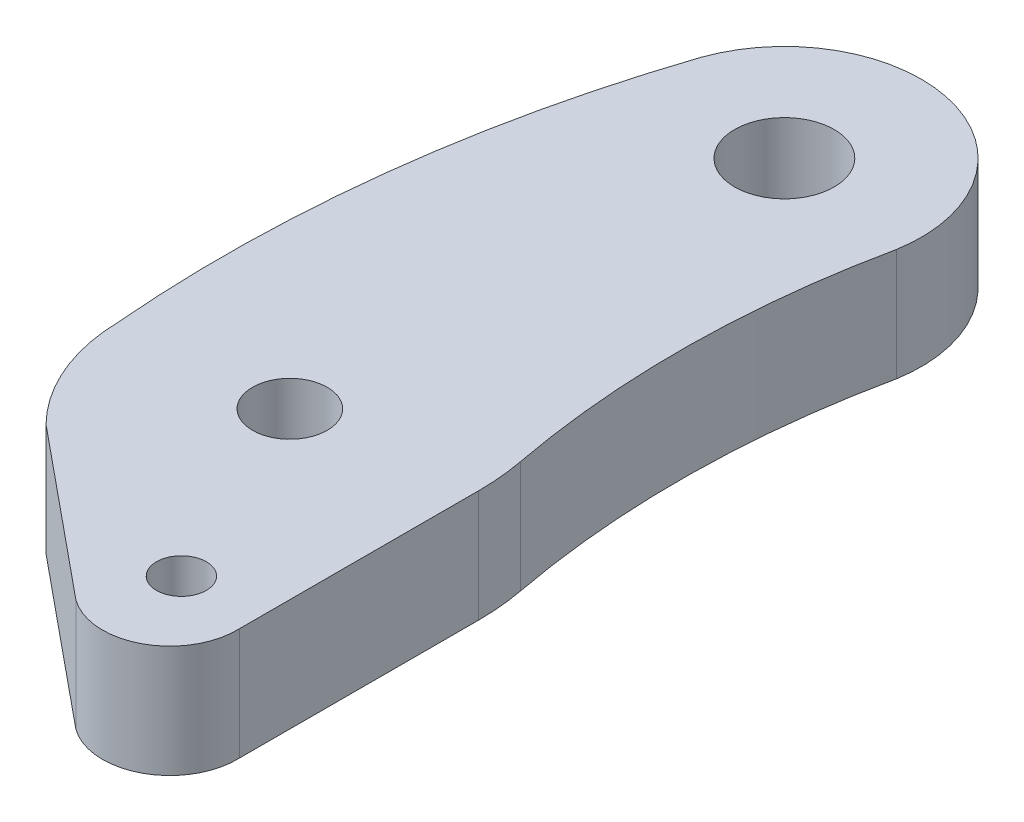
ISO-10303-21;
HEADER;
FILE_DESCRIPTION(('STEP AP214'),'2;1');
FILE_NAME('part.step','',(''),(''),'','','');
FILE_SCHEMA(('AUTOMOTIVE_DESIGN { 1 0 10303 214 1 1 1 1 }'));
ENDSEC;
DATA;
#1=APPLICATION_CONTEXT('core data for automotive mechanical design processes');
#2=APPLICATION_PROTOCOL_DEFINITION('international standard','automotive_design',2000,#1);
#3=PRODUCT_CONTEXT('',#1,'mechanical');
#4=PRODUCT('Part','Part','',(#3));
#5=PRODUCT_RELATED_PRODUCT_CATEGORY('part','',(#4));
#6=PRODUCT_DEFINITION_FORMATION('','',#4);
#7=PRODUCT_DEFINITION_CONTEXT('part definition',#1,'design');
#8=PRODUCT_DEFINITION('design','',#6,#7);
#9=PRODUCT_DEFINITION_SHAPE('','',#8);
#10=(LENGTH_UNIT() NAMED_UNIT(*) SI_UNIT(.MILLI.,.METRE.));
#11=(NAMED_UNIT(*) PLANE_ANGLE_UNIT() SI_UNIT($,.RADIAN.));
#12=(NAMED_UNIT(*) SI_UNIT($,.STERADIAN.) SOLID_ANGLE_UNIT());
#13=UNCERTAINTY_MEASURE_WITH_UNIT(LENGTH_MEASURE(1.E-05),#10,'distance_accuracy_value','');
#14=(GEOMETRIC_REPRESENTATION_CONTEXT(3) GLOBAL_UNCERTAINTY_ASSIGNED_CONTEXT((#13)) GLOBAL_UNIT_ASSIGNED_CONTEXT((#10,
#11,#12)) REPRESENTATION_CONTEXT('',''));
#15=CARTESIAN_POINT('',(0.,0.,0.));
#16=DIRECTION('',(0.,0.,1.));
#17=DIRECTION('',(1.,0.,0.));
#18=AXIS2_PLACEMENT_3D('',#15,#16,#17);
#19=CARTESIAN_POINT('',(0.8616171125143,4.5,0.302707870060248));
#20=DIRECTION('',(0.,-1.,0.));
#21=DIRECTION('',(0.,0.,-1.));
#22=AXIS2_PLACEMENT_3D('',#19,#20,#21);
#23=CYLINDRICAL_SURFACE('',#22,7.31995644636775);
#24=CARTESIAN_POINT('',(0.8616171125143,0.,0.302707870060248));
#25=DIRECTION('',(0.,1.,0.));
#26=DIRECTION('',(0.,0.,1.));
#27=AXIS2_PLACEMENT_3D('',#24,#25,#26);
#28=CIRCLE('',#27,7.31995644636775);
#29=CARTESIAN_POINT('',(-6.45646365427627,0.,0.468407198516391));
#30=VERTEX_POINT('',#29);
#31=CARTESIAN_POINT('',(-4.35726675596251,0.,5.43544725016454));
#32=VERTEX_POINT('',#31);
#33=EDGE_CURVE('E136',#30,#32,#28,.T.);
#34=ORIENTED_EDGE('',*,*,#33,.T.);
#35=DIRECTION('',(0.,-1.,0.));
#36=VECTOR('',#35,1.);
#37=CARTESIAN_POINT('',(-4.35726675596251,4.5,5.43544725016454));
#38=LINE('',#37,#36);
#39=CARTESIAN_POINT('',(-4.35726675596251,4.5,5.43544725016454));
#40=VERTEX_POINT('',#39);
#41=EDGE_CURVE('E113',#40,#32,#38,.T.);
#42=ORIENTED_EDGE('',*,*,#41,.F.);
#43=CARTESIAN_POINT('',(0.8616171125143,4.5,0.302707870060248));
#44=DIRECTION('',(0.,1.,0.));
#45=DIRECTION('',(0.,0.,1.));
#46=AXIS2_PLACEMENT_3D('',#43,#44,#45);
#47=CIRCLE('',#46,7.31995644636775);
#48=CARTESIAN_POINT('',(-6.45646365427627,4.5,0.468407198516391));
#49=VERTEX_POINT('',#48);
#50=EDGE_CURVE('E122',#49,#40,#47,.T.);
#51=ORIENTED_EDGE('',*,*,#50,.F.);
#52=DIRECTION('',(0.,-1.,0.));
#53=VECTOR('',#52,1.);
#54=CARTESIAN_POINT('',(-6.45646365427627,4.5,0.468407198516391));
#55=LINE('',#54,#53);
#56=EDGE_CURVE('E160',#49,#30,#55,.T.);
#57=ORIENTED_EDGE('',*,*,#56,.T.);
#58=EDGE_LOOP('',(#34,#42,#51,#57));
#59=FACE_BOUND('',#58,.T.);
#60=ADVANCED_FACE('F45',(#59),#23,.T.);
#61=CARTESIAN_POINT('',(-4.42044930258775,4.5,5.38356804255398));
#62=DIRECTION('',(0.63458791977798,0.,-0.772850679026587));
#63=DIRECTION('',(-0.772850679026587,0.,-0.63458791977798));
#64=AXIS2_PLACEMENT_3D('',#61,#62,#63);
#65=PLANE('',#64);
#66=DIRECTION('',(0.772850679026587,0.,0.63458791977798));
#67=VECTOR('',#66,1.);
#68=CARTESIAN_POINT('',(-4.42044930258775,0.,5.38356804255398));
#69=LINE('',#68,#67);
#70=CARTESIAN_POINT('',(2.3442580183746,0.,10.9380712127177));
#71=VERTEX_POINT('',#70);
#72=EDGE_CURVE('E185',#32,#71,#69,.T.);
#73=ORIENTED_EDGE('',*,*,#72,.T.);
#74=DIRECTION('',(0.,-1.,0.));
#75=VECTOR('',#74,1.);
#76=CARTESIAN_POINT('',(2.3442580183746,4.5,10.9380712127177));
#77=LINE('',#76,#75);
#78=CARTESIAN_POINT('',(2.3442580183746,4.5,10.9380712127177));
#79=VERTEX_POINT('',#78);
#80=EDGE_CURVE('E116',#79,#71,#77,.T.);
#81=ORIENTED_EDGE('',*,*,#80,.F.);
#82=DIRECTION('',(0.772850679026587,0.,0.63458791977798));
#83=VECTOR('',#82,1.);
#84=CARTESIAN_POINT('',(-4.42044930258775,4.5,5.38356804255398));
#85=LINE('',#84,#83);
#86=EDGE_CURVE('E109',#40,#79,#85,.T.);
#87=ORIENTED_EDGE('',*,*,#86,.F.);
#88=ORIENTED_EDGE('',*,*,#41,.T.);
#89=EDGE_LOOP('',(#73,#81,#87,#88));
#90=FACE_BOUND('',#89,.T.);
#91=ADVANCED_FACE('F111',(#90),#65,.F.);
#92=CARTESIAN_POINT('',(3.93644232712354,4.5,8.7570895793624));
#93=DIRECTION('',(0.,-1.,0.));
#94=DIRECTION('',(0.,0.,-1.));
#95=AXIS2_PLACEMENT_3D('',#92,#93,#94);
#96=CYLINDRICAL_SURFACE('',#95,2.70032067689368);
#97=CARTESIAN_POINT('',(3.93644232712354,0.,8.7570895793624));
#98=DIRECTION('',(0.,1.,0.));
#99=DIRECTION('',(0.,0.,1.));
#100=AXIS2_PLACEMENT_3D('',#97,#98,#99);
#101=CIRCLE('',#100,2.70032067689368);
#102=CARTESIAN_POINT('',(6.63499386695858,0.,8.6593585970003));
#103=VERTEX_POINT('',#102);
#104=EDGE_CURVE('E181',#71,#103,#101,.T.);
#105=ORIENTED_EDGE('',*,*,#104,.T.);
#106=DIRECTION('',(0.,-1.,0.));
#107=VECTOR('',#106,1.);
#108=CARTESIAN_POINT('',(6.63499386695858,4.5,8.6593585970003));
#109=LINE('',#108,#107);
#110=CARTESIAN_POINT('',(6.63499386695858,4.5,8.6593585970003));
#111=VERTEX_POINT('',#110);
#112=EDGE_CURVE('E144',#111,#103,#109,.T.);
#113=ORIENTED_EDGE('',*,*,#112,.F.);
#114=CARTESIAN_POINT('',(3.93644232712354,4.5,8.7570895793624));
#115=DIRECTION('',(0.,1.,0.));
#116=DIRECTION('',(0.,0.,1.));
#117=AXIS2_PLACEMENT_3D('',#114,#115,#116);
#118=CIRCLE('',#117,2.70032067689368);
#119=EDGE_CURVE('E121',#79,#111,#118,.T.);
#120=ORIENTED_EDGE('',*,*,#119,.F.);
#121=ORIENTED_EDGE('',*,*,#80,.T.);
#122=EDGE_LOOP('',(#105,#113,#120,#121));
#123=FACE_BOUND('',#122,.T.);
#124=ADVANCED_FACE('F259',(#123),#96,.T.);
#125=CARTESIAN_POINT('',(6.63985661183784,4.5,0.00373028133380072));
#126=DIRECTION('',(0.999999842189581,0.,0.000561801400721958));
#127=DIRECTION('',(0.000561801400721958,0.,-0.999999842189581));
#128=AXIS2_PLACEMENT_3D('',#125,#126,#127);
#129=PLANE('',#128);
#130=DIRECTION('',(-0.000561801400721958,0.,0.999999842189581));
#131=VECTOR('',#130,1.);
#132=CARTESIAN_POINT('',(6.63985661183784,0.,0.00373028133380072));
#133=LINE('',#132,#131);
#134=CARTESIAN_POINT('',(6.64038488534049,0.,-0.936590299225135));
#135=VERTEX_POINT('',#134);
#136=EDGE_CURVE('E178',#135,#103,#133,.T.);
#137=ORIENTED_EDGE('',*,*,#136,.F.);
#138=DIRECTION('',(0.,-1.,0.));
#139=VECTOR('',#138,1.);
#140=CARTESIAN_POINT('',(6.64038488534049,4.5,-0.936590299225135));
#141=LINE('',#140,#139);
#142=CARTESIAN_POINT('',(6.64038488534049,4.5,-0.936590299225135));
#143=VERTEX_POINT('',#142);
#144=EDGE_CURVE('E54',#135,#143,#141,.F.);
#145=ORIENTED_EDGE('',*,*,#144,.T.);
#146=DIRECTION('',(-0.000561801400721958,0.,0.999999842189581));
#147=VECTOR('',#146,1.);
#148=CARTESIAN_POINT('',(6.63985661183784,4.5,0.00373028133380072));
#149=LINE('',#148,#147);
#150=EDGE_CURVE('E210',#143,#111,#149,.T.);
#151=ORIENTED_EDGE('',*,*,#150,.T.);
#152=ORIENTED_EDGE('',*,*,#112,.T.);
#153=EDGE_LOOP('',(#137,#145,#151,#152));
#154=FACE_BOUND('',#153,.T.);
#155=ADVANCED_FACE('F264',(#154),#129,.T.);
#156=CARTESIAN_POINT('',(43.7196884591617,4.5,-9.83150865206928));
#157=DIRECTION('',(0.,-1.,0.));
#158=DIRECTION('',(0.,0.,-1.));
#159=AXIS2_PLACEMENT_3D('',#156,#157,#158);
#160=CYLINDRICAL_SURFACE('',#159,37.9111713164891);
#161=CARTESIAN_POINT('',(43.7196884591617,4.5,-9.83150865206928));
#162=DIRECTION('',(0.,1.,0.));
#163=DIRECTION('',(0.,0.,1.));
#164=AXIS2_PLACEMENT_3D('',#161,#162,#163);
#165=CIRCLE('',#164,37.9111713164891);
#166=CARTESIAN_POINT('',(6.63788451211919,4.5,-17.7179987852838));
#167=VERTEX_POINT('',#166);
#168=CARTESIAN_POINT('',(6.4667590404629,4.5,-2.7975794291077));
#169=VERTEX_POINT('',#168);
#170=EDGE_CURVE('E206',#167,#169,#165,.T.);
#171=ORIENTED_EDGE('',*,*,#170,.T.);
#172=DIRECTION('',(0.,-1.,0.));
#173=VECTOR('',#172,1.);
#174=CARTESIAN_POINT('',(6.4667590404629,4.5,-2.7975794291077));
#175=LINE('',#174,#173);
#176=CARTESIAN_POINT('',(6.4667590404629,0.,-2.7975794291077));
#177=VERTEX_POINT('',#176);
#178=EDGE_CURVE('E138',#169,#177,#175,.T.);
#179=ORIENTED_EDGE('',*,*,#178,.T.);
#180=CARTESIAN_POINT('',(43.7196884591617,0.,-9.83150865206928));
#181=DIRECTION('',(0.,1.,0.));
#182=DIRECTION('',(0.,0.,1.));
#183=AXIS2_PLACEMENT_3D('',#180,#181,#182);
#184=CIRCLE('',#183,37.9111713164891);
#185=CARTESIAN_POINT('',(6.63788451211919,0.,-17.7179987852838));
#186=VERTEX_POINT('',#185);
#187=EDGE_CURVE('E175',#186,#177,#184,.T.);
#188=ORIENTED_EDGE('',*,*,#187,.F.);
#189=DIRECTION('',(0.,-1.,0.));
#190=VECTOR('',#189,1.);
#191=CARTESIAN_POINT('',(6.63788451211919,4.5,-17.7179987852838));
#192=LINE('',#191,#190);
#193=EDGE_CURVE('E153',#167,#186,#192,.T.);
#194=ORIENTED_EDGE('',*,*,#193,.F.);
#195=EDGE_LOOP('',(#171,#179,#188,#194));
#196=FACE_BOUND('',#195,.T.);
#197=ADVANCED_FACE('F268',(#196),#160,.F.);
#198=CARTESIAN_POINT('',(1.21615678384532,4.5,-18.6425897437439));
#199=DIRECTION('',(0.,-1.,0.));
#200=DIRECTION('',(0.,0.,-1.));
#201=AXIS2_PLACEMENT_3D('',#198,#199,#200);
#202=CYLINDRICAL_SURFACE('',#201,5.5);
#203=CARTESIAN_POINT('',(1.21615678384532,0.,-18.6425897437439));
#204=DIRECTION('',(0.,1.,0.));
#205=DIRECTION('',(0.,0.,1.));
#206=AXIS2_PLACEMENT_3D('',#203,#204,#205);
#207=CIRCLE('',#206,5.5);
#208=CARTESIAN_POINT('',(-3.9671666096012,0.,-20.4819261999014));
#209=VERTEX_POINT('',#208);
#210=EDGE_CURVE('E172',#186,#209,#207,.T.);
#211=ORIENTED_EDGE('',*,*,#210,.T.);
#212=DIRECTION('',(0.,-1.,0.));
#213=VECTOR('',#212,1.);
#214=CARTESIAN_POINT('',(-3.9671666096012,4.5,-20.4819261999014));
#215=LINE('',#214,#213);
#216=CARTESIAN_POINT('',(-3.9671666096012,4.5,-20.4819261999014));
#217=VERTEX_POINT('',#216);
#218=EDGE_CURVE('E156',#217,#209,#215,.T.);
#219=ORIENTED_EDGE('',*,*,#218,.F.);
#220=CARTESIAN_POINT('',(1.21615678384532,4.5,-18.6425897437439));
#221=DIRECTION('',(0.,1.,0.));
#222=DIRECTION('',(0.,0.,1.));
#223=AXIS2_PLACEMENT_3D('',#220,#221,#222);
#224=CIRCLE('',#223,5.5);
#225=EDGE_CURVE('E203',#167,#217,#224,.T.);
#226=ORIENTED_EDGE('',*,*,#225,.F.);
#227=ORIENTED_EDGE('',*,*,#193,.T.);
#228=EDGE_LOOP('',(#211,#219,#226,#227));
#229=FACE_BOUND('',#228,.T.);
#230=ADVANCED_FACE('F271',(#229),#202,.T.);
#231=CARTESIAN_POINT('',(45.6837673674452,4.5,-3.95939878841382));
#232=DIRECTION('',(0.,-1.,0.));
#233=DIRECTION('',(0.,0.,-1.));
#234=AXIS2_PLACEMENT_3D('',#231,#232,#233);
#235=CYLINDRICAL_SURFACE('',#234,52.3279003673603);
#236=CARTESIAN_POINT('',(45.6837673674452,0.,-3.95939878841382));
#237=DIRECTION('',(0.,1.,0.));
#238=DIRECTION('',(0.,0.,1.));
#239=AXIS2_PLACEMENT_3D('',#236,#237,#238);
#240=CIRCLE('',#239,52.3279003673603);
#241=EDGE_CURVE('E169',#209,#30,#240,.T.);
#242=ORIENTED_EDGE('',*,*,#241,.T.);
#243=ORIENTED_EDGE('',*,*,#56,.F.);
#244=CARTESIAN_POINT('',(45.6837673674452,4.5,-3.95939878841382));
#245=DIRECTION('',(0.,1.,0.));
#246=DIRECTION('',(0.,0.,1.));
#247=AXIS2_PLACEMENT_3D('',#244,#245,#246);
#248=CIRCLE('',#247,52.3279003673603);
#249=EDGE_CURVE('E128',#217,#49,#248,.T.);
#250=ORIENTED_EDGE('',*,*,#249,.F.);
#251=ORIENTED_EDGE('',*,*,#218,.T.);
#252=EDGE_LOOP('',(#242,#243,#250,#251));
#253=FACE_BOUND('',#252,.T.);
#254=ADVANCED_FACE('F235',(#253),#235,.T.);
#255=CARTESIAN_POINT('',(0.,4.5,0.));
#256=DIRECTION('',(0.,-1.,0.));
#257=DIRECTION('',(0.,0.,-1.));
#258=AXIS2_PLACEMENT_3D('',#255,#256,#257);
#259=CYLINDRICAL_SURFACE('',#258,1.5);
#260=CARTESIAN_POINT('',(0.,4.5,0.));
#261=DIRECTION('',(0.,1.,0.));
#262=DIRECTION('',(0.,0.,1.));
#263=AXIS2_PLACEMENT_3D('',#260,#261,#262);
#264=CIRCLE('',#263,1.5);
#265=CARTESIAN_POINT('',(0.,4.5,1.5));
#266=VERTEX_POINT('',#265);
#267=EDGE_CURVE('E133',#266,#266,#264,.T.);
#268=ORIENTED_EDGE('',*,*,#267,.T.);
#269=EDGE_LOOP('',(#268));
#270=FACE_BOUND('',#269,.T.);
#271=CARTESIAN_POINT('',(0.,0.,0.));
#272=DIRECTION('',(0.,1.,0.));
#273=DIRECTION('',(0.,0.,1.));
#274=AXIS2_PLACEMENT_3D('',#271,#272,#273);
#275=CIRCLE('',#274,1.5);
#276=CARTESIAN_POINT('',(0.,0.,1.5));
#277=VERTEX_POINT('',#276);
#278=EDGE_CURVE('E190',#277,#277,#275,.T.);
#279=ORIENTED_EDGE('',*,*,#278,.F.);
#280=EDGE_LOOP('',(#279));
#281=FACE_BOUND('',#280,.T.);
#282=ADVANCED_FACE('F232',(#270,#281),#259,.F.);
#283=CARTESIAN_POINT('',(1.21615678384532,4.5,-18.6425897437439));
#284=DIRECTION('',(0.,-1.,0.));
#285=DIRECTION('',(0.,0.,-1.));
#286=AXIS2_PLACEMENT_3D('',#283,#284,#285);
#287=CYLINDRICAL_SURFACE('',#286,2.);
#288=CARTESIAN_POINT('',(1.21615678384532,4.5,-18.6425897437439));
#289=DIRECTION('',(0.,1.,0.));
#290=DIRECTION('',(0.,0.,1.));
#291=AXIS2_PLACEMENT_3D('',#288,#289,#290);
#292=CIRCLE('',#291,2.);
#293=CARTESIAN_POINT('',(1.21615678384532,4.5,-16.6425897437439));
#294=VERTEX_POINT('',#293);
#295=EDGE_CURVE('E168',#294,#294,#292,.T.);
#296=ORIENTED_EDGE('',*,*,#295,.T.);
#297=EDGE_LOOP('',(#296));
#298=FACE_BOUND('',#297,.T.);
#299=CARTESIAN_POINT('',(1.21615678384532,0.,-18.6425897437439));
#300=DIRECTION('',(0.,1.,0.));
#301=DIRECTION('',(0.,0.,1.));
#302=AXIS2_PLACEMENT_3D('',#299,#300,#301);
#303=CIRCLE('',#302,2.);
#304=CARTESIAN_POINT('',(1.21615678384532,0.,-16.6425897437439));
#305=VERTEX_POINT('',#304);
#306=EDGE_CURVE('E194',#305,#305,#303,.T.);
#307=ORIENTED_EDGE('',*,*,#306,.F.);
#308=EDGE_LOOP('',(#307));
#309=FACE_BOUND('',#308,.T.);
#310=ADVANCED_FACE('F222',(#298,#309),#287,.F.);
#311=CARTESIAN_POINT('',(3.64018051988799,4.5,7.99541623783157));
#312=DIRECTION('',(0.,-1.,0.));
#313=DIRECTION('',(0.,0.,-1.));
#314=AXIS2_PLACEMENT_3D('',#311,#312,#313);
#315=CYLINDRICAL_SURFACE('',#314,1.);
#316=CARTESIAN_POINT('',(3.64018051988799,4.5,7.99541623783157));
#317=DIRECTION('',(0.,1.,0.));
#318=DIRECTION('',(0.,0.,1.));
#319=AXIS2_PLACEMENT_3D('',#316,#317,#318);
#320=CIRCLE('',#319,1.);
#321=CARTESIAN_POINT('',(3.64018051988799,4.5,8.99541623783157));
#322=VERTEX_POINT('',#321);
#323=EDGE_CURVE('E163',#322,#322,#320,.T.);
#324=ORIENTED_EDGE('',*,*,#323,.T.);
#325=EDGE_LOOP('',(#324));
#326=FACE_BOUND('',#325,.T.);
#327=CARTESIAN_POINT('',(3.64018051988799,0.,7.99541623783157));
#328=DIRECTION('',(0.,1.,0.));
#329=DIRECTION('',(0.,0.,1.));
#330=AXIS2_PLACEMENT_3D('',#327,#328,#329);
#331=CIRCLE('',#330,1.);
#332=CARTESIAN_POINT('',(3.64018051988799,0.,8.99541623783157));
#333=VERTEX_POINT('',#332);
#334=EDGE_CURVE('E164',#333,#333,#331,.T.);
#335=ORIENTED_EDGE('',*,*,#334,.F.);
#336=EDGE_LOOP('',(#335));
#337=FACE_BOUND('',#336,.T.);
#338=ADVANCED_FACE('F228',(#326,#337),#315,.F.);
#339=CARTESIAN_POINT('',(0.,4.5,0.));
#340=DIRECTION('',(0.,1.,0.));
#341=DIRECTION('',(0.,0.,1.));
#342=AXIS2_PLACEMENT_3D('',#339,#340,#341);
#343=PLANE('',#342);
#344=ORIENTED_EDGE('',*,*,#295,.F.);
#345=EDGE_LOOP('',(#344));
#346=FACE_BOUND('',#345,.T.);
#347=ORIENTED_EDGE('',*,*,#267,.F.);
#348=EDGE_LOOP('',(#347));
#349=FACE_BOUND('',#348,.T.);
#350=ORIENTED_EDGE('',*,*,#150,.F.);
#351=CARTESIAN_POINT('',(-3.35961353655531,4.5,-0.942208313232355));
#352=DIRECTION('',(0.,1.,0.));
#353=DIRECTION('',(0.,0.,1.));
#354=AXIS2_PLACEMENT_3D('',#351,#352,#353);
#355=CIRCLE('',#354,10.);
#356=EDGE_CURVE('E11',#143,#169,#355,.T.);
#357=ORIENTED_EDGE('',*,*,#356,.T.);
#358=ORIENTED_EDGE('',*,*,#170,.F.);
#359=ORIENTED_EDGE('',*,*,#225,.T.);
#360=ORIENTED_EDGE('',*,*,#249,.T.);
#361=ORIENTED_EDGE('',*,*,#50,.T.);
#362=ORIENTED_EDGE('',*,*,#86,.T.);
#363=ORIENTED_EDGE('',*,*,#119,.T.);
#364=EDGE_LOOP('',(#350,#357,#358,#359,#360,#361,#362,#363));
#365=FACE_BOUND('',#364,.T.);
#366=ORIENTED_EDGE('',*,*,#323,.F.);
#367=EDGE_LOOP('',(#366));
#368=FACE_BOUND('',#367,.T.);
#369=ADVANCED_FACE('F125',(#346,#349,#365,#368),#343,.T.);
#370=CARTESIAN_POINT('',(0.,0.,0.));
#371=DIRECTION('',(0.,1.,0.));
#372=DIRECTION('',(0.,0.,1.));
#373=AXIS2_PLACEMENT_3D('',#370,#371,#372);
#374=PLANE('',#373);
#375=ORIENTED_EDGE('',*,*,#306,.T.);
#376=EDGE_LOOP('',(#375));
#377=FACE_BOUND('',#376,.T.);
#378=ORIENTED_EDGE('',*,*,#278,.T.);
#379=EDGE_LOOP('',(#378));
#380=FACE_BOUND('',#379,.T.);
#381=ORIENTED_EDGE('',*,*,#187,.T.);
#382=CARTESIAN_POINT('',(-3.35961353655531,0.,-0.942208313232355));
#383=DIRECTION('',(0.,1.,0.));
#384=DIRECTION('',(0.,0.,1.));
#385=AXIS2_PLACEMENT_3D('',#382,#383,#384);
#386=CIRCLE('',#385,10.);
#387=EDGE_CURVE('E68',#177,#135,#386,.F.);
#388=ORIENTED_EDGE('',*,*,#387,.T.);
#389=ORIENTED_EDGE('',*,*,#136,.T.);
#390=ORIENTED_EDGE('',*,*,#104,.F.);
#391=ORIENTED_EDGE('',*,*,#72,.F.);
#392=ORIENTED_EDGE('',*,*,#33,.F.);
#393=ORIENTED_EDGE('',*,*,#241,.F.);
#394=ORIENTED_EDGE('',*,*,#210,.F.);
#395=EDGE_LOOP('',(#381,#388,#389,#390,#391,#392,#393,#394));
#396=FACE_BOUND('',#395,.T.);
#397=ORIENTED_EDGE('',*,*,#334,.T.);
#398=EDGE_LOOP('',(#397));
#399=FACE_BOUND('',#398,.T.);
#400=ADVANCED_FACE('F227',(#377,#380,#396,#399),#374,.F.);
#401=CARTESIAN_POINT('',(-3.35961353655531,4.5,-0.942208313232355));
#402=DIRECTION('',(0.,-1.,0.));
#403=DIRECTION('',(0.,0.,-1.));
#404=AXIS2_PLACEMENT_3D('',#401,#402,#403);
#405=CYLINDRICAL_SURFACE('',#404,10.);
#406=ORIENTED_EDGE('',*,*,#356,.F.);
#407=ORIENTED_EDGE('',*,*,#144,.F.);
#408=ORIENTED_EDGE('',*,*,#387,.F.);
#409=ORIENTED_EDGE('',*,*,#178,.F.);
#410=EDGE_LOOP('',(#406,#407,#408,#409));
#411=FACE_BOUND('',#410,.T.);
#412=ADVANCED_FACE('F47',(#411),#405,.T.);
#413=CLOSED_SHELL('',(#60,#91,#124,#155,#197,#230,#254,#282,#310,#338,#369,#400,#412));
#414=MANIFOLD_SOLID_BREP('B2',#413);
#415=ADVANCED_BREP_SHAPE_REPRESENTATION('',(#18,#414),#14);
#416=SHAPE_DEFINITION_REPRESENTATION(#9,#415);
ENDSEC;
END-ISO-10303-21;
